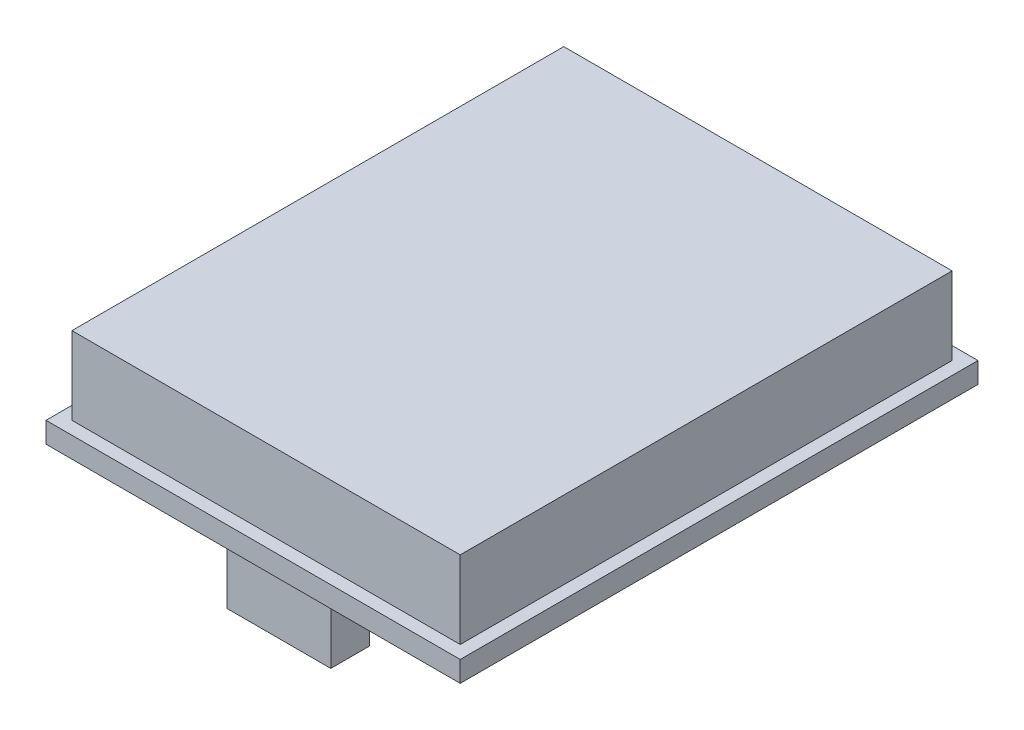
ISO-10303-21;
HEADER;
FILE_DESCRIPTION(('STEP AP214'),'2;1');
FILE_NAME('part.step','',(''),(''),'','','');
FILE_SCHEMA(('AUTOMOTIVE_DESIGN { 1 0 10303 214 1 1 1 1 }'));
ENDSEC;
DATA;
#1=APPLICATION_CONTEXT('core data for automotive mechanical design processes');
#2=APPLICATION_PROTOCOL_DEFINITION('international standard','automotive_design',2000,#1);
#3=PRODUCT_CONTEXT('',#1,'mechanical');
#4=PRODUCT('Part','Part','',(#3));
#5=PRODUCT_RELATED_PRODUCT_CATEGORY('part','',(#4));
#6=PRODUCT_DEFINITION_FORMATION('','',#4);
#7=PRODUCT_DEFINITION_CONTEXT('part definition',#1,'design');
#8=PRODUCT_DEFINITION('design','',#6,#7);
#9=PRODUCT_DEFINITION_SHAPE('','',#8);
#10=(LENGTH_UNIT() NAMED_UNIT(*) SI_UNIT(.MILLI.,.METRE.));
#11=(NAMED_UNIT(*) PLANE_ANGLE_UNIT() SI_UNIT($,.RADIAN.));
#12=(NAMED_UNIT(*) SI_UNIT($,.STERADIAN.) SOLID_ANGLE_UNIT());
#13=UNCERTAINTY_MEASURE_WITH_UNIT(LENGTH_MEASURE(1.E-05),#10,'distance_accuracy_value','');
#14=(GEOMETRIC_REPRESENTATION_CONTEXT(3) GLOBAL_UNCERTAINTY_ASSIGNED_CONTEXT((#13)) GLOBAL_UNIT_ASSIGNED_CONTEXT((#10,
#11,#12)) REPRESENTATION_CONTEXT('',''));
#15=CARTESIAN_POINT('',(0.,0.,0.));
#16=DIRECTION('',(0.,0.,1.));
#17=DIRECTION('',(1.,0.,0.));
#18=AXIS2_PLACEMENT_3D('',#15,#16,#17);
#19=CARTESIAN_POINT('',(0.,0.,0.));
#20=DIRECTION('',(0.,-1.,0.));
#21=DIRECTION('',(0.,0.,-1.));
#22=AXIS2_PLACEMENT_3D('',#19,#20,#21);
#23=PLANE('',#22);
#24=DIRECTION('',(0.,0.,1.));
#25=VECTOR('',#24,1.);
#26=CARTESIAN_POINT('',(0.,0.,0.));
#27=LINE('',#26,#25);
#28=CARTESIAN_POINT('',(0.,0.,-40.));
#29=VERTEX_POINT('',#28);
#30=CARTESIAN_POINT('',(0.,0.,0.));
#31=VERTEX_POINT('',#30);
#32=EDGE_CURVE('E204',#29,#31,#27,.T.);
#33=ORIENTED_EDGE('',*,*,#32,.F.);
#34=DIRECTION('',(-1.,0.,0.));
#35=VECTOR('',#34,1.);
#36=CARTESIAN_POINT('',(0.,0.,-40.));
#37=LINE('',#36,#35);
#38=CARTESIAN_POINT('',(32.,0.,-40.));
#39=VERTEX_POINT('',#38);
#40=EDGE_CURVE('E210',#39,#29,#37,.T.);
#41=ORIENTED_EDGE('',*,*,#40,.F.);
#42=DIRECTION('',(0.,0.,-1.));
#43=VECTOR('',#42,1.);
#44=CARTESIAN_POINT('',(32.,0.,0.));
#45=LINE('',#44,#43);
#46=CARTESIAN_POINT('',(32.,0.,0.));
#47=VERTEX_POINT('',#46);
#48=EDGE_CURVE('E226',#47,#39,#45,.T.);
#49=ORIENTED_EDGE('',*,*,#48,.F.);
#50=DIRECTION('',(1.,0.,0.));
#51=VECTOR('',#50,1.);
#52=CARTESIAN_POINT('',(0.,0.,0.));
#53=LINE('',#52,#51);
#54=EDGE_CURVE('E223',#31,#47,#53,.T.);
#55=ORIENTED_EDGE('',*,*,#54,.F.);
#56=EDGE_LOOP('',(#33,#41,#49,#55));
#57=FACE_BOUND('',#56,.T.);
#58=DIRECTION('',(1.,0.,0.));
#59=VECTOR('',#58,1.);
#60=CARTESIAN_POINT('',(12.,0.,-5.));
#61=LINE('',#60,#59);
#62=CARTESIAN_POINT('',(12.,0.,-5.));
#63=VERTEX_POINT('',#62);
#64=CARTESIAN_POINT('',(20.,0.,-5.));
#65=VERTEX_POINT('',#64);
#66=EDGE_CURVE('E407',#63,#65,#61,.T.);
#67=ORIENTED_EDGE('',*,*,#66,.F.);
#68=DIRECTION('',(0.,0.,-1.));
#69=VECTOR('',#68,1.);
#70=CARTESIAN_POINT('',(12.,0.,-2.));
#71=LINE('',#70,#69);
#72=CARTESIAN_POINT('',(12.,0.,-2.));
#73=VERTEX_POINT('',#72);
#74=EDGE_CURVE('E154',#73,#63,#71,.T.);
#75=ORIENTED_EDGE('',*,*,#74,.F.);
#76=DIRECTION('',(-1.,0.,0.));
#77=VECTOR('',#76,1.);
#78=CARTESIAN_POINT('',(12.,0.,-2.));
#79=LINE('',#78,#77);
#80=CARTESIAN_POINT('',(20.,0.,-2.));
#81=VERTEX_POINT('',#80);
#82=EDGE_CURVE('E150',#81,#73,#79,.T.);
#83=ORIENTED_EDGE('',*,*,#82,.F.);
#84=DIRECTION('',(0.,0.,1.));
#85=VECTOR('',#84,1.);
#86=CARTESIAN_POINT('',(20.,0.,-2.));
#87=LINE('',#86,#85);
#88=EDGE_CURVE('E403',#65,#81,#87,.T.);
#89=ORIENTED_EDGE('',*,*,#88,.F.);
#90=EDGE_LOOP('',(#67,#75,#83,#89));
#91=FACE_BOUND('',#90,.T.);
#92=ADVANCED_FACE('F39',(#57,#91),#23,.T.);
#93=CARTESIAN_POINT('',(0.,1.6,0.));
#94=DIRECTION('',(0.,-1.,0.));
#95=DIRECTION('',(0.,0.,-1.));
#96=AXIS2_PLACEMENT_3D('',#93,#94,#95);
#97=PLANE('',#96);
#98=DIRECTION('',(0.,0.,1.));
#99=VECTOR('',#98,1.);
#100=CARTESIAN_POINT('',(0.,1.6,0.));
#101=LINE('',#100,#99);
#102=CARTESIAN_POINT('',(0.,1.6,-40.));
#103=VERTEX_POINT('',#102);
#104=CARTESIAN_POINT('',(0.,1.6,0.));
#105=VERTEX_POINT('',#104);
#106=EDGE_CURVE('E205',#103,#105,#101,.T.);
#107=ORIENTED_EDGE('',*,*,#106,.T.);
#108=DIRECTION('',(1.,0.,0.));
#109=VECTOR('',#108,1.);
#110=CARTESIAN_POINT('',(0.,1.6,0.));
#111=LINE('',#110,#109);
#112=CARTESIAN_POINT('',(32.,1.6,0.));
#113=VERTEX_POINT('',#112);
#114=EDGE_CURVE('E209',#105,#113,#111,.T.);
#115=ORIENTED_EDGE('',*,*,#114,.T.);
#116=DIRECTION('',(0.,0.,-1.));
#117=VECTOR('',#116,1.);
#118=CARTESIAN_POINT('',(32.,1.6,0.));
#119=LINE('',#118,#117);
#120=CARTESIAN_POINT('',(32.,1.6,-40.));
#121=VERTEX_POINT('',#120);
#122=EDGE_CURVE('E213',#113,#121,#119,.T.);
#123=ORIENTED_EDGE('',*,*,#122,.T.);
#124=DIRECTION('',(-1.,0.,0.));
#125=VECTOR('',#124,1.);
#126=CARTESIAN_POINT('',(0.,1.6,-40.));
#127=LINE('',#126,#125);
#128=EDGE_CURVE('E216',#121,#103,#127,.T.);
#129=ORIENTED_EDGE('',*,*,#128,.T.);
#130=EDGE_LOOP('',(#107,#115,#123,#129));
#131=FACE_BOUND('',#130,.T.);
#132=DIRECTION('',(1.,0.,0.));
#133=VECTOR('',#132,1.);
#134=CARTESIAN_POINT('',(1.,1.6,-1.));
#135=LINE('',#134,#133);
#136=CARTESIAN_POINT('',(1.,1.6,-1.));
#137=VERTEX_POINT('',#136);
#138=CARTESIAN_POINT('',(31.,1.6,-1.));
#139=VERTEX_POINT('',#138);
#140=EDGE_CURVE('E63',#137,#139,#135,.T.);
#141=ORIENTED_EDGE('',*,*,#140,.F.);
#142=DIRECTION('',(0.,0.,1.));
#143=VECTOR('',#142,1.);
#144=CARTESIAN_POINT('',(1.,1.6,-39.));
#145=LINE('',#144,#143);
#146=CARTESIAN_POINT('',(1.,1.6,-39.));
#147=VERTEX_POINT('',#146);
#148=EDGE_CURVE('E170',#147,#137,#145,.T.);
#149=ORIENTED_EDGE('',*,*,#148,.F.);
#150=DIRECTION('',(-1.,0.,0.));
#151=VECTOR('',#150,1.);
#152=CARTESIAN_POINT('',(31.,1.6,-39.));
#153=LINE('',#152,#151);
#154=CARTESIAN_POINT('',(31.,1.6,-39.));
#155=VERTEX_POINT('',#154);
#156=EDGE_CURVE('E183',#155,#147,#153,.T.);
#157=ORIENTED_EDGE('',*,*,#156,.F.);
#158=DIRECTION('',(0.,0.,-1.));
#159=VECTOR('',#158,1.);
#160=CARTESIAN_POINT('',(31.,1.6,-1.));
#161=LINE('',#160,#159);
#162=EDGE_CURVE('E160',#139,#155,#161,.T.);
#163=ORIENTED_EDGE('',*,*,#162,.F.);
#164=EDGE_LOOP('',(#141,#149,#157,#163));
#165=FACE_BOUND('',#164,.T.);
#166=ADVANCED_FACE('F258',(#131,#165),#97,.F.);
#167=CARTESIAN_POINT('',(0.,1.6,0.));
#168=DIRECTION('',(1.,0.,0.));
#169=DIRECTION('',(0.,0.,-1.));
#170=AXIS2_PLACEMENT_3D('',#167,#168,#169);
#171=PLANE('',#170);
#172=ORIENTED_EDGE('',*,*,#32,.T.);
#173=DIRECTION('',(0.,-1.,0.));
#174=VECTOR('',#173,1.);
#175=CARTESIAN_POINT('',(0.,1.6,0.));
#176=LINE('',#175,#174);
#177=EDGE_CURVE('E11',#105,#31,#176,.T.);
#178=ORIENTED_EDGE('',*,*,#177,.F.);
#179=ORIENTED_EDGE('',*,*,#106,.F.);
#180=DIRECTION('',(0.,-1.,0.));
#181=VECTOR('',#180,1.);
#182=CARTESIAN_POINT('',(0.,1.6,-40.));
#183=LINE('',#182,#181);
#184=EDGE_CURVE('E219',#103,#29,#183,.T.);
#185=ORIENTED_EDGE('',*,*,#184,.T.);
#186=EDGE_LOOP('',(#172,#178,#179,#185));
#187=FACE_BOUND('',#186,.T.);
#188=ADVANCED_FACE('F41',(#187),#171,.F.);
#189=CARTESIAN_POINT('',(0.,1.6,0.));
#190=DIRECTION('',(0.,0.,-1.));
#191=DIRECTION('',(-1.,0.,0.));
#192=AXIS2_PLACEMENT_3D('',#189,#190,#191);
#193=PLANE('',#192);
#194=ORIENTED_EDGE('',*,*,#54,.T.);
#195=DIRECTION('',(0.,-1.,0.));
#196=VECTOR('',#195,1.);
#197=CARTESIAN_POINT('',(32.,1.6,0.));
#198=LINE('',#197,#196);
#199=EDGE_CURVE('E48',#113,#47,#198,.T.);
#200=ORIENTED_EDGE('',*,*,#199,.F.);
#201=ORIENTED_EDGE('',*,*,#114,.F.);
#202=ORIENTED_EDGE('',*,*,#177,.T.);
#203=EDGE_LOOP('',(#194,#200,#201,#202));
#204=FACE_BOUND('',#203,.T.);
#205=ADVANCED_FACE('F259',(#204),#193,.F.);
#206=CARTESIAN_POINT('',(32.,1.6,0.));
#207=DIRECTION('',(-1.,0.,0.));
#208=DIRECTION('',(0.,0.,1.));
#209=AXIS2_PLACEMENT_3D('',#206,#207,#208);
#210=PLANE('',#209);
#211=ORIENTED_EDGE('',*,*,#48,.T.);
#212=DIRECTION('',(0.,-1.,0.));
#213=VECTOR('',#212,1.);
#214=CARTESIAN_POINT('',(32.,1.6,-40.));
#215=LINE('',#214,#213);
#216=EDGE_CURVE('E234',#121,#39,#215,.T.);
#217=ORIENTED_EDGE('',*,*,#216,.F.);
#218=ORIENTED_EDGE('',*,*,#122,.F.);
#219=ORIENTED_EDGE('',*,*,#199,.T.);
#220=EDGE_LOOP('',(#211,#217,#218,#219));
#221=FACE_BOUND('',#220,.T.);
#222=ADVANCED_FACE('F243',(#221),#210,.F.);
#223=CARTESIAN_POINT('',(0.,1.6,-40.));
#224=DIRECTION('',(0.,0.,1.));
#225=DIRECTION('',(1.,0.,0.));
#226=AXIS2_PLACEMENT_3D('',#223,#224,#225);
#227=PLANE('',#226);
#228=ORIENTED_EDGE('',*,*,#40,.T.);
#229=ORIENTED_EDGE('',*,*,#184,.F.);
#230=ORIENTED_EDGE('',*,*,#128,.F.);
#231=ORIENTED_EDGE('',*,*,#216,.T.);
#232=EDGE_LOOP('',(#228,#229,#230,#231));
#233=FACE_BOUND('',#232,.T.);
#234=ADVANCED_FACE('F252',(#233),#227,.F.);
#235=CARTESIAN_POINT('',(1.,7.6,-1.));
#236=DIRECTION('',(0.,0.,-1.));
#237=DIRECTION('',(-1.,0.,0.));
#238=AXIS2_PLACEMENT_3D('',#235,#236,#237);
#239=PLANE('',#238);
#240=ORIENTED_EDGE('',*,*,#140,.T.);
#241=DIRECTION('',(0.,-1.,0.));
#242=VECTOR('',#241,1.);
#243=CARTESIAN_POINT('',(31.,7.6,-1.));
#244=LINE('',#243,#242);
#245=CARTESIAN_POINT('',(31.,7.6,-1.));
#246=VERTEX_POINT('',#245);
#247=EDGE_CURVE('E200',#246,#139,#244,.T.);
#248=ORIENTED_EDGE('',*,*,#247,.F.);
#249=DIRECTION('',(1.,0.,0.));
#250=VECTOR('',#249,1.);
#251=CARTESIAN_POINT('',(1.,7.6,-1.));
#252=LINE('',#251,#250);
#253=CARTESIAN_POINT('',(1.,7.6,-1.));
#254=VERTEX_POINT('',#253);
#255=EDGE_CURVE('E165',#254,#246,#252,.T.);
#256=ORIENTED_EDGE('',*,*,#255,.F.);
#257=DIRECTION('',(0.,-1.,0.));
#258=VECTOR('',#257,1.);
#259=CARTESIAN_POINT('',(1.,7.6,-1.));
#260=LINE('',#259,#258);
#261=EDGE_CURVE('E178',#254,#137,#260,.T.);
#262=ORIENTED_EDGE('',*,*,#261,.T.);
#263=EDGE_LOOP('',(#240,#248,#256,#262));
#264=FACE_BOUND('',#263,.T.);
#265=ADVANCED_FACE('F275',(#264),#239,.F.);
#266=CARTESIAN_POINT('',(31.,7.6,-1.));
#267=DIRECTION('',(-1.,0.,0.));
#268=DIRECTION('',(0.,0.,1.));
#269=AXIS2_PLACEMENT_3D('',#266,#267,#268);
#270=PLANE('',#269);
#271=ORIENTED_EDGE('',*,*,#162,.T.);
#272=DIRECTION('',(0.,-1.,0.));
#273=VECTOR('',#272,1.);
#274=CARTESIAN_POINT('',(31.,7.6,-39.));
#275=LINE('',#274,#273);
#276=CARTESIAN_POINT('',(31.,7.6,-39.));
#277=VERTEX_POINT('',#276);
#278=EDGE_CURVE('E196',#277,#155,#275,.T.);
#279=ORIENTED_EDGE('',*,*,#278,.F.);
#280=DIRECTION('',(0.,0.,-1.));
#281=VECTOR('',#280,1.);
#282=CARTESIAN_POINT('',(31.,7.6,-1.));
#283=LINE('',#282,#281);
#284=EDGE_CURVE('E169',#246,#277,#283,.T.);
#285=ORIENTED_EDGE('',*,*,#284,.F.);
#286=ORIENTED_EDGE('',*,*,#247,.T.);
#287=EDGE_LOOP('',(#271,#279,#285,#286));
#288=FACE_BOUND('',#287,.T.);
#289=ADVANCED_FACE('F279',(#288),#270,.F.);
#290=CARTESIAN_POINT('',(31.,7.6,-39.));
#291=DIRECTION('',(0.,0.,1.));
#292=DIRECTION('',(1.,0.,0.));
#293=AXIS2_PLACEMENT_3D('',#290,#291,#292);
#294=PLANE('',#293);
#295=ORIENTED_EDGE('',*,*,#156,.T.);
#296=DIRECTION('',(0.,-1.,0.));
#297=VECTOR('',#296,1.);
#298=CARTESIAN_POINT('',(1.,7.6,-39.));
#299=LINE('',#298,#297);
#300=CARTESIAN_POINT('',(1.,7.6,-39.));
#301=VERTEX_POINT('',#300);
#302=EDGE_CURVE('E192',#301,#147,#299,.T.);
#303=ORIENTED_EDGE('',*,*,#302,.F.);
#304=DIRECTION('',(-1.,0.,0.));
#305=VECTOR('',#304,1.);
#306=CARTESIAN_POINT('',(31.,7.6,-39.));
#307=LINE('',#306,#305);
#308=EDGE_CURVE('E173',#277,#301,#307,.T.);
#309=ORIENTED_EDGE('',*,*,#308,.F.);
#310=ORIENTED_EDGE('',*,*,#278,.T.);
#311=EDGE_LOOP('',(#295,#303,#309,#310));
#312=FACE_BOUND('',#311,.T.);
#313=ADVANCED_FACE('F284',(#312),#294,.F.);
#314=CARTESIAN_POINT('',(1.,7.6,-39.));
#315=DIRECTION('',(1.,0.,0.));
#316=DIRECTION('',(0.,0.,-1.));
#317=AXIS2_PLACEMENT_3D('',#314,#315,#316);
#318=PLANE('',#317);
#319=ORIENTED_EDGE('',*,*,#148,.T.);
#320=ORIENTED_EDGE('',*,*,#261,.F.);
#321=DIRECTION('',(0.,0.,1.));
#322=VECTOR('',#321,1.);
#323=CARTESIAN_POINT('',(1.,7.6,-39.));
#324=LINE('',#323,#322);
#325=EDGE_CURVE('E176',#301,#254,#324,.T.);
#326=ORIENTED_EDGE('',*,*,#325,.F.);
#327=ORIENTED_EDGE('',*,*,#302,.T.);
#328=EDGE_LOOP('',(#319,#320,#326,#327));
#329=FACE_BOUND('',#328,.T.);
#330=ADVANCED_FACE('F290',(#329),#318,.F.);
#331=CARTESIAN_POINT('',(0.,7.6,0.));
#332=DIRECTION('',(0.,1.,0.));
#333=DIRECTION('',(0.,0.,1.));
#334=AXIS2_PLACEMENT_3D('',#331,#332,#333);
#335=PLANE('',#334);
#336=ORIENTED_EDGE('',*,*,#255,.T.);
#337=ORIENTED_EDGE('',*,*,#284,.T.);
#338=ORIENTED_EDGE('',*,*,#308,.T.);
#339=ORIENTED_EDGE('',*,*,#325,.T.);
#340=EDGE_LOOP('',(#336,#337,#338,#339));
#341=FACE_BOUND('',#340,.T.);
#342=ADVANCED_FACE('F294',(#341),#335,.T.);
#343=CARTESIAN_POINT('',(12.,-6.,-2.));
#344=DIRECTION('',(1.,0.,0.));
#345=DIRECTION('',(0.,0.,-1.));
#346=AXIS2_PLACEMENT_3D('',#343,#344,#345);
#347=PLANE('',#346);
#348=ORIENTED_EDGE('',*,*,#74,.T.);
#349=DIRECTION('',(0.,1.,0.));
#350=VECTOR('',#349,1.);
#351=CARTESIAN_POINT('',(12.,-6.,-5.));
#352=LINE('',#351,#350);
#353=CARTESIAN_POINT('',(12.,-6.,-5.));
#354=VERTEX_POINT('',#353);
#355=EDGE_CURVE('E133',#354,#63,#352,.T.);
#356=ORIENTED_EDGE('',*,*,#355,.F.);
#357=DIRECTION('',(0.,0.,-1.));
#358=VECTOR('',#357,1.);
#359=CARTESIAN_POINT('',(12.,-6.,-2.));
#360=LINE('',#359,#358);
#361=CARTESIAN_POINT('',(12.,-6.,-2.));
#362=VERTEX_POINT('',#361);
#363=EDGE_CURVE('E141',#362,#354,#360,.T.);
#364=ORIENTED_EDGE('',*,*,#363,.F.);
#365=DIRECTION('',(0.,1.,0.));
#366=VECTOR('',#365,1.);
#367=CARTESIAN_POINT('',(12.,-6.,-2.));
#368=LINE('',#367,#366);
#369=EDGE_CURVE('E400',#362,#73,#368,.T.);
#370=ORIENTED_EDGE('',*,*,#369,.T.);
#371=EDGE_LOOP('',(#348,#356,#364,#370));
#372=FACE_BOUND('',#371,.T.);
#373=ADVANCED_FACE('F152',(#372),#347,.F.);
#374=CARTESIAN_POINT('',(12.,-6.,-5.));
#375=DIRECTION('',(0.,0.,1.));
#376=DIRECTION('',(1.,0.,0.));
#377=AXIS2_PLACEMENT_3D('',#374,#375,#376);
#378=PLANE('',#377);
#379=ORIENTED_EDGE('',*,*,#66,.T.);
#380=DIRECTION('',(0.,1.,0.));
#381=VECTOR('',#380,1.);
#382=CARTESIAN_POINT('',(20.,-6.,-5.));
#383=LINE('',#382,#381);
#384=CARTESIAN_POINT('',(20.,-6.,-5.));
#385=VERTEX_POINT('',#384);
#386=EDGE_CURVE('E136',#385,#65,#383,.T.);
#387=ORIENTED_EDGE('',*,*,#386,.F.);
#388=DIRECTION('',(1.,0.,0.));
#389=VECTOR('',#388,1.);
#390=CARTESIAN_POINT('',(12.,-6.,-5.));
#391=LINE('',#390,#389);
#392=EDGE_CURVE('E129',#354,#385,#391,.T.);
#393=ORIENTED_EDGE('',*,*,#392,.F.);
#394=ORIENTED_EDGE('',*,*,#355,.T.);
#395=EDGE_LOOP('',(#379,#387,#393,#394));
#396=FACE_BOUND('',#395,.T.);
#397=ADVANCED_FACE('F131',(#396),#378,.F.);
#398=CARTESIAN_POINT('',(20.,-6.,-2.));
#399=DIRECTION('',(-1.,0.,0.));
#400=DIRECTION('',(0.,0.,1.));
#401=AXIS2_PLACEMENT_3D('',#398,#399,#400);
#402=PLANE('',#401);
#403=ORIENTED_EDGE('',*,*,#88,.T.);
#404=DIRECTION('',(0.,1.,0.));
#405=VECTOR('',#404,1.);
#406=CARTESIAN_POINT('',(20.,-6.,-2.));
#407=LINE('',#406,#405);
#408=CARTESIAN_POINT('',(20.,-6.,-2.));
#409=VERTEX_POINT('',#408);
#410=EDGE_CURVE('E55',#409,#81,#407,.T.);
#411=ORIENTED_EDGE('',*,*,#410,.F.);
#412=DIRECTION('',(0.,0.,1.));
#413=VECTOR('',#412,1.);
#414=CARTESIAN_POINT('',(20.,-6.,-2.));
#415=LINE('',#414,#413);
#416=EDGE_CURVE('E140',#385,#409,#415,.T.);
#417=ORIENTED_EDGE('',*,*,#416,.F.);
#418=ORIENTED_EDGE('',*,*,#386,.T.);
#419=EDGE_LOOP('',(#403,#411,#417,#418));
#420=FACE_BOUND('',#419,.T.);
#421=ADVANCED_FACE('F303',(#420),#402,.F.);
#422=CARTESIAN_POINT('',(12.,-6.,-2.));
#423=DIRECTION('',(0.,0.,-1.));
#424=DIRECTION('',(-1.,0.,0.));
#425=AXIS2_PLACEMENT_3D('',#422,#423,#424);
#426=PLANE('',#425);
#427=ORIENTED_EDGE('',*,*,#82,.T.);
#428=ORIENTED_EDGE('',*,*,#369,.F.);
#429=DIRECTION('',(-1.,0.,0.));
#430=VECTOR('',#429,1.);
#431=CARTESIAN_POINT('',(12.,-6.,-2.));
#432=LINE('',#431,#430);
#433=EDGE_CURVE('E145',#409,#362,#432,.T.);
#434=ORIENTED_EDGE('',*,*,#433,.F.);
#435=ORIENTED_EDGE('',*,*,#410,.T.);
#436=EDGE_LOOP('',(#427,#428,#434,#435));
#437=FACE_BOUND('',#436,.T.);
#438=ADVANCED_FACE('F306',(#437),#426,.F.);
#439=CARTESIAN_POINT('',(0.,-6.,0.));
#440=DIRECTION('',(0.,-1.,0.));
#441=DIRECTION('',(0.,0.,-1.));
#442=AXIS2_PLACEMENT_3D('',#439,#440,#441);
#443=PLANE('',#442);
#444=ORIENTED_EDGE('',*,*,#363,.T.);
#445=ORIENTED_EDGE('',*,*,#392,.T.);
#446=ORIENTED_EDGE('',*,*,#416,.T.);
#447=ORIENTED_EDGE('',*,*,#433,.T.);
#448=EDGE_LOOP('',(#444,#445,#446,#447));
#449=FACE_BOUND('',#448,.T.);
#450=ADVANCED_FACE('F144',(#449),#443,.T.);
#451=CLOSED_SHELL('',(#92,#166,#188,#205,#222,#234,#265,#289,#313,#330,#342,#373,#397,#421,#438,#450));
#452=MANIFOLD_SOLID_BREP('B2',#451);
#453=ADVANCED_BREP_SHAPE_REPRESENTATION('',(#18,#452),#14);
#454=SHAPE_DEFINITION_REPRESENTATION(#9,#453);
ENDSEC;
END-ISO-10303-21;
